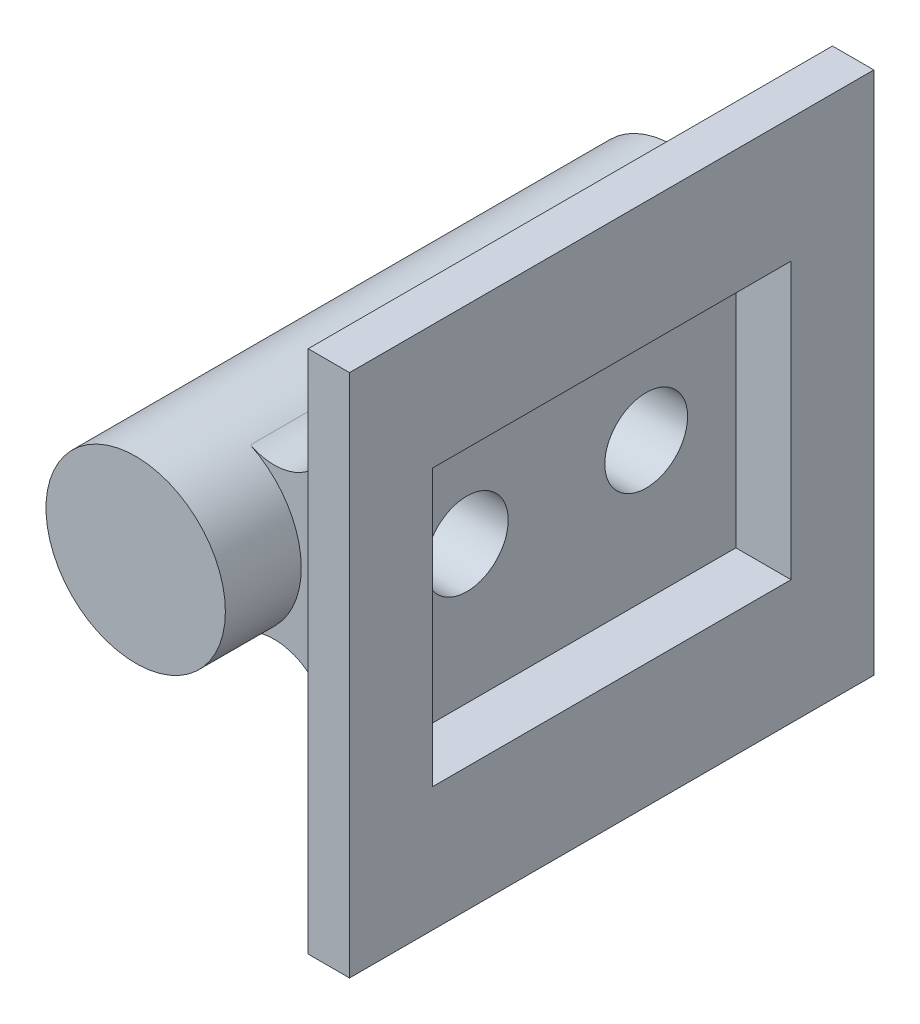
ISO-10303-21;
HEADER;
FILE_DESCRIPTION(('STEP AP214'),'2;1');
FILE_NAME('part.step','',(''),(''),'','','');
FILE_SCHEMA(('AUTOMOTIVE_DESIGN { 1 0 10303 214 1 1 1 1 }'));
ENDSEC;
DATA;
#1=APPLICATION_CONTEXT('core data for automotive mechanical design processes');
#2=APPLICATION_PROTOCOL_DEFINITION('international standard','automotive_design',2000,#1);
#3=PRODUCT_CONTEXT('',#1,'mechanical');
#4=PRODUCT('Part','Part','',(#3));
#5=PRODUCT_RELATED_PRODUCT_CATEGORY('part','',(#4));
#6=PRODUCT_DEFINITION_FORMATION('','',#4);
#7=PRODUCT_DEFINITION_CONTEXT('part definition',#1,'design');
#8=PRODUCT_DEFINITION('design','',#6,#7);
#9=PRODUCT_DEFINITION_SHAPE('','',#8);
#10=(LENGTH_UNIT() NAMED_UNIT(*) SI_UNIT(.MILLI.,.METRE.));
#11=(NAMED_UNIT(*) PLANE_ANGLE_UNIT() SI_UNIT($,.RADIAN.));
#12=(NAMED_UNIT(*) SI_UNIT($,.STERADIAN.) SOLID_ANGLE_UNIT());
#13=UNCERTAINTY_MEASURE_WITH_UNIT(LENGTH_MEASURE(1.E-05),#10,'distance_accuracy_value','');
#14=(GEOMETRIC_REPRESENTATION_CONTEXT(3) GLOBAL_UNCERTAINTY_ASSIGNED_CONTEXT((#13)) GLOBAL_UNIT_ASSIGNED_CONTEXT((#10,
#11,#12)) REPRESENTATION_CONTEXT('',''));
#15=CARTESIAN_POINT('',(0.,0.,0.));
#16=DIRECTION('',(0.,0.,1.));
#17=DIRECTION('',(1.,0.,0.));
#18=AXIS2_PLACEMENT_3D('',#15,#16,#17);
#19=CARTESIAN_POINT('',(-3.25,0.,6.50000000000001));
#20=DIRECTION('',(1.,0.,0.));
#21=DIRECTION('',(0.,0.,-1.));
#22=AXIS2_PLACEMENT_3D('',#19,#20,#21);
#23=CYLINDRICAL_SURFACE('',#22,1.5);
#24=CARTESIAN_POINT('',(-3.25,0.,5.00000000000001));
#25=CARTESIAN_POINT('',(-3.24999648247277,0.0795665336020403,5.00000421247905));
#26=CARTESIAN_POINT('',(-3.24704578523041,0.159248802751997,5.00636813471365));
#27=CARTESIAN_POINT('',(-3.2355347898597,0.316302676462146,5.03156318118426));
#28=CARTESIAN_POINT('',(-3.22696181322454,0.393668644355888,5.05042248408738));
#29=CARTESIAN_POINT('',(-3.2051126172015,0.543571236651894,5.09973866091747));
#30=CARTESIAN_POINT('',(-3.19185368124057,0.616124459577146,5.13015294660304));
#31=CARTESIAN_POINT('',(-3.16188428643622,0.755011505863267,5.2015168335497));
#32=CARTESIAN_POINT('',(-3.14517445431165,0.821346455351668,5.2424645221658));
#33=CARTESIAN_POINT('',(-3.10883035500972,0.949934488652827,5.33625870420049));
#34=CARTESIAN_POINT('',(-3.08908710707928,1.01177584846844,5.38962691087942));
#35=CARTESIAN_POINT('',(-3.04931006025544,1.12599874800721,5.50563562764809));
#36=CARTESIAN_POINT('',(-3.02927608328388,1.17837420047775,5.56828205752165));
#37=CARTESIAN_POINT('',(-2.98974101022941,1.27548887178323,5.70586094331575));
#38=CARTESIAN_POINT('',(-2.97035435123641,1.31953284801044,5.78132069821355));
#39=CARTESIAN_POINT('',(-2.93608939546151,1.39412192936299,5.93958674698915));
#40=CARTESIAN_POINT('',(-2.92120827864052,1.42467548371612,6.0223884033991));
#41=CARTESIAN_POINT('',(-2.89884571395906,1.46962454078475,6.18827547315313));
#42=CARTESIAN_POINT('',(-2.8910015734653,1.4848179245708,6.27109361958574));
#43=CARTESIAN_POINT('',(-2.88259066686592,1.50108773838038,6.43844572930717));
#44=CARTESIAN_POINT('',(-2.88201842715938,1.50217478633585,6.52297835408688));
#45=CARTESIAN_POINT('',(-2.88791642352155,1.49079280088205,6.68247431559392));
#46=CARTESIAN_POINT('',(-2.89370119933259,1.47964335102251,6.75756278880917));
#47=CARTESIAN_POINT('',(-2.91048067828192,1.44635609280636,6.90465111612117));
#48=CARTESIAN_POINT('',(-2.92147667875396,1.42421554815286,6.97665019624376));
#49=CARTESIAN_POINT('',(-2.94769456359194,1.36913890476633,7.11750428412667));
#50=CARTESIAN_POINT('',(-2.96300763226557,1.33596673085205,7.18624922737944));
#51=CARTESIAN_POINT('',(-2.99612519429948,1.2599408085694,7.31750076894383));
#52=CARTESIAN_POINT('',(-3.01393076717331,1.21708286028503,7.38000464401993));
#53=CARTESIAN_POINT('',(-3.05231404472979,1.11759089744586,7.50397040691343));
#54=CARTESIAN_POINT('',(-3.07298560052006,1.05997849303938,7.56462052865888));
#55=CARTESIAN_POINT('',(-3.11321361515149,0.935250632841352,7.67570550486449));
#56=CARTESIAN_POINT('',(-3.13276968136724,0.868131859637576,7.72613677828395));
#57=CARTESIAN_POINT('',(-3.16938837780687,0.723348423753624,7.81693190630663));
#58=CARTESIAN_POINT('',(-3.18634309674009,0.645401966429365,7.85689330775828));
#59=CARTESIAN_POINT('',(-3.21497815103089,0.482909298354604,7.92283936054928));
#60=CARTESIAN_POINT('',(-3.22666207188811,0.398367620109635,7.94883351551928));
#61=CARTESIAN_POINT('',(-3.2427218040747,0.231801419726402,7.98424157682711));
#62=CARTESIAN_POINT('',(-3.24757449131577,0.150053680320637,7.99474020756894));
#63=CARTESIAN_POINT('',(-3.25100513162603,-0.0141754579229654,8.00218106493396));
#64=CARTESIAN_POINT('',(-3.2495854463303,-0.0966565689646155,7.9991283938078));
#65=CARTESIAN_POINT('',(-3.24092695083229,-0.254447728851398,7.98025949138189));
#66=CARTESIAN_POINT('',(-3.23406471548409,-0.32987981592277,7.96526898368199));
#67=CARTESIAN_POINT('',(-3.21565473000495,-0.477039681748182,7.92417402923192));
#68=CARTESIAN_POINT('',(-3.20410642645936,-0.548767021851264,7.89806826977628));
#69=CARTESIAN_POINT('',(-3.17695345815228,-0.689005049925915,7.83468234372052));
#70=CARTESIAN_POINT('',(-3.1612347190555,-0.757348407882686,7.79708250267826));
#71=CARTESIAN_POINT('',(-3.12733589867659,-0.88699936318638,7.71212462567629));
#72=CARTESIAN_POINT('',(-3.10915473706587,-0.948303850462287,7.66476230187561));
#73=CARTESIAN_POINT('',(-3.07030240901949,-1.0677160558966,7.55688298141909));
#74=CARTESIAN_POINT('',(-3.04955167366765,-1.12509321772053,7.4955841650681));
#75=CARTESIAN_POINT('',(-3.00917431114152,-1.22901796417977,7.36402884468214));
#76=CARTESIAN_POINT('',(-2.9895481899615,-1.27556070251232,7.293768353704));
#77=CARTESIAN_POINT('',(-2.95315331683976,-1.35774539209928,7.1434877774402));
#78=CARTESIAN_POINT('',(-2.93648892202037,-1.39301513194685,7.06323680814686));
#79=CARTESIAN_POINT('',(-2.90918351058036,-1.44918714325353,6.89691227690631));
#80=CARTESIAN_POINT('',(-2.89853600922792,-1.47010488786372,6.81084509588307));
#81=CARTESIAN_POINT('',(-2.88561745322169,-1.49529060984287,6.64356783076452));
#82=CARTESIAN_POINT('',(-2.8826853235251,-1.50087454782971,6.56260705814636));
#83=CARTESIAN_POINT('',(-2.88371144444688,-1.49890349615771,6.40090062167266));
#84=CARTESIAN_POINT('',(-2.88766788080262,-1.49135196602765,6.32015490678602));
#85=CARTESIAN_POINT('',(-2.90136714358001,-1.4645026372222,6.16705490877214));
#86=CARTESIAN_POINT('',(-2.91068674382725,-1.44606164108053,6.09450832744066));
#87=CARTESIAN_POINT('',(-2.93364049026732,-1.39890570133608,5.95356687370679));
#88=CARTESIAN_POINT('',(-2.94727591136076,-1.37018772156748,5.88517323521492));
#89=CARTESIAN_POINT('',(-2.97843128061352,-1.30114142777073,5.74953399950376));
#90=CARTESIAN_POINT('',(-2.99614786625048,-1.26017322224185,5.68266041329159));
#91=CARTESIAN_POINT('',(-3.0330436879651,-1.16858143831046,5.55633112462378));
#92=CARTESIAN_POINT('',(-3.05222358907507,-1.11795345395621,5.49687882766469));
#93=CARTESIAN_POINT('',(-3.09212207628571,-1.00267081983323,5.38109157335565));
#94=CARTESIAN_POINT('',(-3.1128088140642,-0.937130722089634,5.32562265597413));
#95=CARTESIAN_POINT('',(-3.15160236946607,-0.796983612052283,5.22634804014506));
#96=CARTESIAN_POINT('',(-3.16970797320059,-0.722372364022922,5.18254782104581));
#97=CARTESIAN_POINT('',(-3.2012362062055,-0.566452903867861,5.10840626489357));
#98=CARTESIAN_POINT('',(-3.21469015731665,-0.485194228853799,5.07797451998735));
#99=CARTESIAN_POINT('',(-3.23548841356123,-0.318047129151275,5.03155777804299));
#100=CARTESIAN_POINT('',(-3.24285100595264,-0.232173392454847,5.01552952677662));
#101=CARTESIAN_POINT('',(-3.24782399252521,-0.121381352624892,5.00472033900516));
#102=CARTESIAN_POINT('',(-3.24863841958619,-0.0971493876498603,5.00295206813927));
#103=CARTESIAN_POINT('',(-3.24972696562435,-0.0486152181100393,5.00059124442133));
#104=CARTESIAN_POINT('',(-3.2500010748449,-0.0243130122848309,4.99999871279985));
#105=CARTESIAN_POINT('',(-3.25,0.,5.00000000000001));
#106=B_SPLINE_CURVE_WITH_KNOTS('',3,(#24,#25,#26,#27,#28,#29,#30,#31,#32,#33,#34,#35,#36,#37,
#38,#39,#40,#41,#42,#43,#44,#45,#46,#47,#48,#49,#50,#51,#52,#53,#54,#55,#56,#57,#58,#59,#60,#61,
#62,#63,#64,#65,#66,#67,#68,#69,#70,#71,#72,#73,#74,#75,#76,#77,#78,#79,#80,#81,#82,#83,#84,#85,
#86,#87,#88,#89,#90,#91,#92,#93,#94,#95,#96,#97,#98,#99,#100,#101,#102,#103,#104,#105),
.UNSPECIFIED.,.T.,.F.,(4,2,2,2,2,2,2,2,2,2,2,2,2,2,2,2,2,2,2,2,2,2,2,2,2,2,2,2,2,2,2,2,2,2,2,2,
2,2,2,2,4),(0.,0.238600102483912,0.477740118245303,0.716007153654804,0.954230955270993,
1.20527368348811,1.45647728005178,1.72361737244145,1.99058991333629,2.24284530975915,
2.49491082085964,2.72224505371487,2.94963591115234,3.1822448933896,3.41495493301191,
3.67231630672516,3.92976771345169,4.19600797435801,4.46206684922304,4.70843465098172,
4.95470969975967,5.18529144757862,5.41590043453885,5.65361863134684,5.8914414611822,
6.14975555625562,6.4081849756982,6.67442949381559,6.94038651584684,7.18267705005868,
7.42490378112663,7.65022078469501,7.87560440949579,8.11582604918683,8.3561575201829,
8.61987112719259,8.88370835055027,9.14573275427444,9.40696763362011,9.47987495044763,
9.5527835837666),.UNSPECIFIED.);
#107=CARTESIAN_POINT('',(-3.25,0.,5.00000000000001));
#108=VERTEX_POINT('',#107);
#109=EDGE_CURVE('E236',#108,#108,#106,.T.);
#110=ORIENTED_EDGE('',*,*,#109,.F.);
#111=EDGE_LOOP('',(#110));
#112=FACE_BOUND('',#111,.T.);
#113=CARTESIAN_POINT('',(5.5,0.,6.50000000000001));
#114=DIRECTION('',(1.,0.,0.));
#115=DIRECTION('',(0.,0.,-1.));
#116=AXIS2_PLACEMENT_3D('',#113,#114,#115);
#117=CIRCLE('',#116,1.5);
#118=CARTESIAN_POINT('',(5.5,0.,5.00000000000001));
#119=VERTEX_POINT('',#118);
#120=EDGE_CURVE('E232',#119,#119,#117,.F.);
#121=ORIENTED_EDGE('',*,*,#120,.F.);
#122=EDGE_LOOP('',(#121));
#123=FACE_BOUND('',#122,.T.);
#124=ADVANCED_FACE('F44',(#112,#123),#23,.F.);
#125=CARTESIAN_POINT('',(-3.25,0.,13.));
#126=DIRECTION('',(1.,0.,0.));
#127=DIRECTION('',(0.,0.,-1.));
#128=AXIS2_PLACEMENT_3D('',#125,#126,#127);
#129=CYLINDRICAL_SURFACE('',#128,1.5);
#130=CARTESIAN_POINT('',(-3.25,0.,11.5));
#131=CARTESIAN_POINT('',(-3.24999648247277,0.0795665336020403,11.500004212479));
#132=CARTESIAN_POINT('',(-3.24704578523041,0.159248802751997,11.5063681347136));
#133=CARTESIAN_POINT('',(-3.2355347898597,0.316302676462146,11.5315631811843));
#134=CARTESIAN_POINT('',(-3.22696181322454,0.393668644355888,11.5504224840874));
#135=CARTESIAN_POINT('',(-3.2051126172015,0.543571236651894,11.5997386609175));
#136=CARTESIAN_POINT('',(-3.19185368124057,0.616124459577146,11.630152946603));
#137=CARTESIAN_POINT('',(-3.16188428643622,0.755011505863267,11.7015168335497));
#138=CARTESIAN_POINT('',(-3.14517445431165,0.821346455351668,11.7424645221658));
#139=CARTESIAN_POINT('',(-3.10883035500972,0.949934488652827,11.8362587042005));
#140=CARTESIAN_POINT('',(-3.08908710707928,1.01177584846844,11.8896269108794));
#141=CARTESIAN_POINT('',(-3.04931006025544,1.12599874800721,12.0056356276481));
#142=CARTESIAN_POINT('',(-3.02927608328388,1.17837420047775,12.0682820575216));
#143=CARTESIAN_POINT('',(-2.9897410102294,1.27548887178323,12.2058609433157));
#144=CARTESIAN_POINT('',(-2.97035435123641,1.31953284801044,12.2813206982136));
#145=CARTESIAN_POINT('',(-2.93608939546151,1.39412192936299,12.4395867469891));
#146=CARTESIAN_POINT('',(-2.92120827864052,1.42467548371612,12.5223884033991));
#147=CARTESIAN_POINT('',(-2.89884571395906,1.46962454078475,12.6882754731531));
#148=CARTESIAN_POINT('',(-2.8910015734653,1.4848179245708,12.7710936195857));
#149=CARTESIAN_POINT('',(-2.88259066686592,1.50108773838038,12.9384457293072));
#150=CARTESIAN_POINT('',(-2.88201842715938,1.50217478633585,13.0229783540869));
#151=CARTESIAN_POINT('',(-2.88791642352155,1.49079280088205,13.1824743155939));
#152=CARTESIAN_POINT('',(-2.89370119933259,1.47964335102251,13.2575627888092));
#153=CARTESIAN_POINT('',(-2.91048067828192,1.44635609280636,13.4046511161212));
#154=CARTESIAN_POINT('',(-2.92147667875396,1.42421554815286,13.4766501962438));
#155=CARTESIAN_POINT('',(-2.94769456359194,1.36913890476633,13.6175042841267));
#156=CARTESIAN_POINT('',(-2.96300763226557,1.33596673085205,13.6862492273794));
#157=CARTESIAN_POINT('',(-2.99612519429948,1.2599408085694,13.8175007689438));
#158=CARTESIAN_POINT('',(-3.01393076717331,1.21708286028503,13.8800046440199));
#159=CARTESIAN_POINT('',(-3.05231404472979,1.11759089744586,14.0039704069134));
#160=CARTESIAN_POINT('',(-3.07298560052006,1.05997849303938,14.0646205286589));
#161=CARTESIAN_POINT('',(-3.11321361515149,0.935250632841354,14.1757055048645));
#162=CARTESIAN_POINT('',(-3.13276968136724,0.868131859637578,14.2261367782839));
#163=CARTESIAN_POINT('',(-3.16938837780687,0.723348423753626,14.3169319063066));
#164=CARTESIAN_POINT('',(-3.18634309674009,0.645401966429367,14.3568933077583));
#165=CARTESIAN_POINT('',(-3.21497815103089,0.482909298354605,14.4228393605493));
#166=CARTESIAN_POINT('',(-3.22666207188811,0.398367620109636,14.4488335155193));
#167=CARTESIAN_POINT('',(-3.2427218040747,0.231801419726403,14.4842415768271));
#168=CARTESIAN_POINT('',(-3.24757449131577,0.150053680320638,14.4947402075689));
#169=CARTESIAN_POINT('',(-3.25100513162603,-0.0141754579229652,14.502181064934));
#170=CARTESIAN_POINT('',(-3.2495854463303,-0.0966565689646154,14.4991283938078));
#171=CARTESIAN_POINT('',(-3.24092695083229,-0.254447728851398,14.4802594913819));
#172=CARTESIAN_POINT('',(-3.23406471548409,-0.32987981592277,14.465268983682));
#173=CARTESIAN_POINT('',(-3.21565473000495,-0.477039681748182,14.4241740292319));
#174=CARTESIAN_POINT('',(-3.20410642645936,-0.548767021851264,14.3980682697763));
#175=CARTESIAN_POINT('',(-3.17695345815228,-0.689005049925915,14.3346823437205));
#176=CARTESIAN_POINT('',(-3.1612347190555,-0.757348407882686,14.2970825026783));
#177=CARTESIAN_POINT('',(-3.12733589867659,-0.88699936318638,14.2121246256763));
#178=CARTESIAN_POINT('',(-3.10915473706587,-0.948303850462288,14.1647623018756));
#179=CARTESIAN_POINT('',(-3.07030240901949,-1.0677160558966,14.0568829814191));
#180=CARTESIAN_POINT('',(-3.04955167366765,-1.12509321772053,13.9955841650681));
#181=CARTESIAN_POINT('',(-3.00917431114152,-1.22901796417977,13.8640288446821));
#182=CARTESIAN_POINT('',(-2.9895481899615,-1.27556070251232,13.793768353704));
#183=CARTESIAN_POINT('',(-2.95315331683976,-1.35774539209928,13.6434877774402));
#184=CARTESIAN_POINT('',(-2.93648892202037,-1.39301513194685,13.5632368081469));
#185=CARTESIAN_POINT('',(-2.90918351058036,-1.44918714325353,13.3969122769063));
#186=CARTESIAN_POINT('',(-2.89853600922792,-1.47010488786372,13.3108450958831));
#187=CARTESIAN_POINT('',(-2.88561745322169,-1.49529060984287,13.1435678307645));
#188=CARTESIAN_POINT('',(-2.8826853235251,-1.50087454782971,13.0626070581464));
#189=CARTESIAN_POINT('',(-2.88371144444688,-1.49890349615772,12.9009006216727));
#190=CARTESIAN_POINT('',(-2.88766788080262,-1.49135196602765,12.820154906786));
#191=CARTESIAN_POINT('',(-2.90136714358001,-1.4645026372222,12.6670549087721));
#192=CARTESIAN_POINT('',(-2.91068674382725,-1.44606164108053,12.5945083274407));
#193=CARTESIAN_POINT('',(-2.93364049026732,-1.39890570133608,12.4535668737068));
#194=CARTESIAN_POINT('',(-2.94727591136076,-1.37018772156748,12.3851732352149));
#195=CARTESIAN_POINT('',(-2.97843128061352,-1.30114142777074,12.2495339995038));
#196=CARTESIAN_POINT('',(-2.99614786625048,-1.26017322224185,12.1826604132916));
#197=CARTESIAN_POINT('',(-3.0330436879651,-1.16858143831046,12.0563311246238));
#198=CARTESIAN_POINT('',(-3.05222358907507,-1.11795345395621,11.9968788276647));
#199=CARTESIAN_POINT('',(-3.09212207628571,-1.00267081983323,11.8810915733557));
#200=CARTESIAN_POINT('',(-3.1128088140642,-0.937130722089635,11.8256226559741));
#201=CARTESIAN_POINT('',(-3.15160236946607,-0.796983612052284,11.7263480401451));
#202=CARTESIAN_POINT('',(-3.16970797320059,-0.722372364022923,11.6825478210458));
#203=CARTESIAN_POINT('',(-3.2012362062055,-0.566452903867862,11.6084062648936));
#204=CARTESIAN_POINT('',(-3.21469015731665,-0.4851942288538,11.5779745199874));
#205=CARTESIAN_POINT('',(-3.23548841356123,-0.318047129151276,11.531557778043));
#206=CARTESIAN_POINT('',(-3.24285100595264,-0.232173392454848,11.5155295267766));
#207=CARTESIAN_POINT('',(-3.24782399252521,-0.121381352624893,11.5047203390052));
#208=CARTESIAN_POINT('',(-3.24863841958619,-0.0971493876498614,11.5029520681393));
#209=CARTESIAN_POINT('',(-3.24972696562435,-0.0486152181100401,11.5005912444213));
#210=CARTESIAN_POINT('',(-3.2500010748449,-0.0243130122848313,11.4999987127998));
#211=CARTESIAN_POINT('',(-3.25,0.,11.5));
#212=B_SPLINE_CURVE_WITH_KNOTS('',3,(#130,#131,#132,#133,#134,#135,#136,#137,#138,#139,#140,
#141,#142,#143,#144,#145,#146,#147,#148,#149,#150,#151,#152,#153,#154,#155,#156,#157,#158,#159,
#160,#161,#162,#163,#164,#165,#166,#167,#168,#169,#170,#171,#172,#173,#174,#175,#176,#177,#178,
#179,#180,#181,#182,#183,#184,#185,#186,#187,#188,#189,#190,#191,#192,#193,#194,#195,#196,#197,
#198,#199,#200,#201,#202,#203,#204,#205,#206,#207,#208,#209,#210,#211),.UNSPECIFIED.,.T.,.F.,(4,
2,2,2,2,2,2,2,2,2,2,2,2,2,2,2,2,2,2,2,2,2,2,2,2,2,2,2,2,2,2,2,2,2,2,2,2,2,2,2,4),(0.,
0.238600102483912,0.477740118245303,0.716007153654804,0.954230955270993,1.20527368348812,
1.45647728005178,1.72361737244145,1.99058991333629,2.24284530975915,2.49491082085964,
2.72224505371487,2.94963591115234,3.1822448933896,3.41495493301191,3.67231630672517,
3.92976771345169,4.19600797435802,4.46206684922304,4.70843465098173,4.95470969975968,
5.18529144757863,5.41590043453886,5.65361863134685,5.89144146118221,6.14975555625563,
6.40818497569821,6.6744294938156,6.94038651584684,7.18267705005868,7.42490378112664,
7.65022078469502,7.8756044094958,8.11582604918684,8.35615752018291,8.6198711271926,
8.88370835055028,9.14573275427445,9.40696763362012,9.47987495044763,9.55278358376661),.UNSPECIFIED.);
#213=CARTESIAN_POINT('',(-3.25,0.,11.5));
#214=VERTEX_POINT('',#213);
#215=EDGE_CURVE('E245',#214,#214,#212,.T.);
#216=ORIENTED_EDGE('',*,*,#215,.F.);
#217=EDGE_LOOP('',(#216));
#218=FACE_BOUND('',#217,.T.);
#219=CARTESIAN_POINT('',(5.5,0.,13.));
#220=DIRECTION('',(1.,0.,0.));
#221=DIRECTION('',(0.,0.,-1.));
#222=AXIS2_PLACEMENT_3D('',#219,#220,#221);
#223=CIRCLE('',#222,1.5);
#224=CARTESIAN_POINT('',(5.5,0.,11.5));
#225=VERTEX_POINT('',#224);
#226=EDGE_CURVE('E48',#225,#225,#223,.F.);
#227=ORIENTED_EDGE('',*,*,#226,.F.);
#228=EDGE_LOOP('',(#227));
#229=FACE_BOUND('',#228,.T.);
#230=ADVANCED_FACE('F258',(#218,#229),#129,.F.);
#231=CARTESIAN_POINT('',(0.,0.,19.5));
#232=DIRECTION('',(0.,0.,-1.));
#233=DIRECTION('',(-1.,0.,0.));
#234=AXIS2_PLACEMENT_3D('',#231,#232,#233);
#235=CYLINDRICAL_SURFACE('',#234,3.25);
#236=ORIENTED_EDGE('',*,*,#215,.T.);
#237=EDGE_LOOP('',(#236));
#238=FACE_BOUND('',#237,.T.);
#239=ORIENTED_EDGE('',*,*,#109,.T.);
#240=EDGE_LOOP('',(#239));
#241=FACE_BOUND('',#240,.T.);
#242=DIRECTION('',(0.,0.,-1.));
#243=VECTOR('',#242,1.);
#244=CARTESIAN_POINT('',(1.40530679379837,-2.93046290119909,19.5));
#245=LINE('',#244,#243);
#246=CARTESIAN_POINT('',(1.40530679379837,-2.93046290119908,2.75));
#247=VERTEX_POINT('',#246);
#248=CARTESIAN_POINT('',(1.40530679379837,-2.93046290119908,16.75));
#249=VERTEX_POINT('',#248);
#250=EDGE_CURVE('E359',#247,#249,#245,.F.);
#251=ORIENTED_EDGE('',*,*,#250,.T.);
#252=CARTESIAN_POINT('',(0.,0.,16.75));
#253=DIRECTION('',(0.,0.,-1.));
#254=DIRECTION('',(-1.,0.,0.));
#255=AXIS2_PLACEMENT_3D('',#252,#253,#254);
#256=CIRCLE('',#255,3.25);
#257=CARTESIAN_POINT('',(1.40530679379837,2.93046290119908,16.75));
#258=VERTEX_POINT('',#257);
#259=EDGE_CURVE('E334',#258,#249,#256,.T.);
#260=ORIENTED_EDGE('',*,*,#259,.F.);
#261=DIRECTION('',(0.,0.,-1.));
#262=VECTOR('',#261,1.);
#263=CARTESIAN_POINT('',(1.40530679379837,2.93046290119908,19.5));
#264=LINE('',#263,#262);
#265=CARTESIAN_POINT('',(1.40530679379837,2.93046290119908,2.75));
#266=VERTEX_POINT('',#265);
#267=EDGE_CURVE('E355',#258,#266,#264,.T.);
#268=ORIENTED_EDGE('',*,*,#267,.T.);
#269=CARTESIAN_POINT('',(0.,0.,2.75));
#270=DIRECTION('',(0.,0.,-1.));
#271=DIRECTION('',(-1.,0.,0.));
#272=AXIS2_PLACEMENT_3D('',#269,#270,#271);
#273=CIRCLE('',#272,3.25);
#274=EDGE_CURVE('E342',#266,#247,#273,.T.);
#275=ORIENTED_EDGE('',*,*,#274,.T.);
#276=EDGE_LOOP('',(#251,#260,#268,#275));
#277=FACE_BOUND('',#276,.T.);
#278=CARTESIAN_POINT('',(0.,0.,19.5));
#279=DIRECTION('',(0.,0.,1.));
#280=DIRECTION('',(1.,0.,0.));
#281=AXIS2_PLACEMENT_3D('',#278,#279,#280);
#282=CIRCLE('',#281,3.25);
#283=CARTESIAN_POINT('',(3.25,0.,19.5));
#284=VERTEX_POINT('',#283);
#285=EDGE_CURVE('E328',#284,#284,#282,.T.);
#286=ORIENTED_EDGE('',*,*,#285,.F.);
#287=EDGE_LOOP('',(#286));
#288=FACE_BOUND('',#287,.T.);
#289=CARTESIAN_POINT('',(0.,0.,0.));
#290=DIRECTION('',(0.,0.,1.));
#291=DIRECTION('',(1.,0.,0.));
#292=AXIS2_PLACEMENT_3D('',#289,#290,#291);
#293=CIRCLE('',#292,3.25);
#294=CARTESIAN_POINT('',(3.25,0.,0.));
#295=VERTEX_POINT('',#294);
#296=EDGE_CURVE('E325',#295,#295,#293,.T.);
#297=ORIENTED_EDGE('',*,*,#296,.T.);
#298=EDGE_LOOP('',(#297));
#299=FACE_BOUND('',#298,.T.);
#300=ADVANCED_FACE('F251',(#238,#241,#277,#288,#299),#235,.T.);
#301=CARTESIAN_POINT('',(0.,0.,19.5));
#302=DIRECTION('',(0.,0.,1.));
#303=DIRECTION('',(1.,0.,0.));
#304=AXIS2_PLACEMENT_3D('',#301,#302,#303);
#305=PLANE('',#304);
#306=ORIENTED_EDGE('',*,*,#285,.T.);
#307=EDGE_LOOP('',(#306));
#308=FACE_BOUND('',#307,.T.);
#309=ADVANCED_FACE('F316',(#308),#305,.T.);
#310=CARTESIAN_POINT('',(0.,0.,0.));
#311=DIRECTION('',(0.,0.,1.));
#312=DIRECTION('',(1.,0.,0.));
#313=AXIS2_PLACEMENT_3D('',#310,#311,#312);
#314=PLANE('',#313);
#315=ORIENTED_EDGE('',*,*,#296,.F.);
#316=EDGE_LOOP('',(#315));
#317=FACE_BOUND('',#316,.T.);
#318=ADVANCED_FACE('F314',(#317),#314,.F.);
#319=CARTESIAN_POINT('',(5.,-4.5,27.045630140987));
#320=DIRECTION('',(-0.66896473162245,-0.743294146247166,0.));
#321=DIRECTION('',(0.743294146247166,-0.66896473162245,0.));
#322=AXIS2_PLACEMENT_3D('',#319,#320,#321);
#323=PLANE('',#322);
#324=DIRECTION('',(-0.743294146247166,0.66896473162245,0.));
#325=VECTOR('',#324,1.);
#326=CARTESIAN_POINT('',(5.,-4.5,2.75));
#327=LINE('',#326,#325);
#328=CARTESIAN_POINT('',(4.3379294632449,-3.90413651692041,2.75));
#329=VERTEX_POINT('',#328);
#330=CARTESIAN_POINT('',(3.60804043784226,-3.24723639405803,2.75));
#331=VERTEX_POINT('',#330);
#332=EDGE_CURVE('E420',#329,#331,#327,.T.);
#333=ORIENTED_EDGE('',*,*,#332,.F.);
#334=DIRECTION('',(0.,0.,-1.));
#335=VECTOR('',#334,1.);
#336=CARTESIAN_POINT('',(4.3379294632449,-3.90413651692041,27.045630140987));
#337=LINE('',#336,#335);
#338=CARTESIAN_POINT('',(4.3379294632449,-3.90413651692041,16.75));
#339=VERTEX_POINT('',#338);
#340=EDGE_CURVE('E352',#329,#339,#337,.F.);
#341=ORIENTED_EDGE('',*,*,#340,.T.);
#342=DIRECTION('',(0.743294146247166,-0.66896473162245,0.));
#343=VECTOR('',#342,1.);
#344=CARTESIAN_POINT('',(5.,-4.5,16.75));
#345=LINE('',#344,#343);
#346=CARTESIAN_POINT('',(3.60804043784226,-3.24723639405803,16.75));
#347=VERTEX_POINT('',#346);
#348=EDGE_CURVE('E337',#347,#339,#345,.T.);
#349=ORIENTED_EDGE('',*,*,#348,.F.);
#350=DIRECTION('',(0.,0.,-1.));
#351=VECTOR('',#350,1.);
#352=CARTESIAN_POINT('',(3.60804043784226,-3.24723639405803,27.045630140987));
#353=LINE('',#352,#351);
#354=EDGE_CURVE('E349',#347,#331,#353,.T.);
#355=ORIENTED_EDGE('',*,*,#354,.T.);
#356=EDGE_LOOP('',(#333,#341,#349,#355));
#357=FACE_BOUND('',#356,.T.);
#358=ADVANCED_FACE('F310',(#357),#323,.T.);
#359=CARTESIAN_POINT('',(0.,0.,27.045630140987));
#360=DIRECTION('',(-0.66896473162245,0.743294146247166,0.));
#361=DIRECTION('',(-0.743294146247166,-0.66896473162245,0.));
#362=AXIS2_PLACEMENT_3D('',#359,#360,#361);
#363=PLANE('',#362);
#364=DIRECTION('',(0.743294146247166,0.66896473162245,0.));
#365=VECTOR('',#364,1.);
#366=CARTESIAN_POINT('',(0.,0.,2.75));
#367=LINE('',#366,#365);
#368=CARTESIAN_POINT('',(3.60804043784226,3.24723639405803,2.75));
#369=VERTEX_POINT('',#368);
#370=CARTESIAN_POINT('',(4.3379294632449,3.90413651692041,2.75));
#371=VERTEX_POINT('',#370);
#372=EDGE_CURVE('E417',#369,#371,#367,.T.);
#373=ORIENTED_EDGE('',*,*,#372,.F.);
#374=DIRECTION('',(0.,0.,-1.));
#375=VECTOR('',#374,1.);
#376=CARTESIAN_POINT('',(3.60804043784226,3.24723639405803,27.045630140987));
#377=LINE('',#376,#375);
#378=CARTESIAN_POINT('',(3.60804043784226,3.24723639405803,16.75));
#379=VERTEX_POINT('',#378);
#380=EDGE_CURVE('E367',#369,#379,#377,.F.);
#381=ORIENTED_EDGE('',*,*,#380,.T.);
#382=DIRECTION('',(-0.743294146247166,-0.66896473162245,0.));
#383=VECTOR('',#382,1.);
#384=CARTESIAN_POINT('',(0.,0.,16.75));
#385=LINE('',#384,#383);
#386=CARTESIAN_POINT('',(4.3379294632449,3.90413651692041,16.75));
#387=VERTEX_POINT('',#386);
#388=EDGE_CURVE('E329',#387,#379,#385,.T.);
#389=ORIENTED_EDGE('',*,*,#388,.F.);
#390=DIRECTION('',(0.,0.,-1.));
#391=VECTOR('',#390,1.);
#392=CARTESIAN_POINT('',(4.3379294632449,3.90413651692041,27.045630140987));
#393=LINE('',#392,#391);
#394=EDGE_CURVE('E363',#387,#371,#393,.T.);
#395=ORIENTED_EDGE('',*,*,#394,.T.);
#396=EDGE_LOOP('',(#373,#381,#389,#395));
#397=FACE_BOUND('',#396,.T.);
#398=ADVANCED_FACE('F307',(#397),#363,.T.);
#399=CARTESIAN_POINT('',(0.,0.,2.75));
#400=DIRECTION('',(0.,0.,-1.));
#401=DIRECTION('',(-1.,0.,0.));
#402=AXIS2_PLACEMENT_3D('',#399,#400,#401);
#403=PLANE('',#402);
#404=ORIENTED_EDGE('',*,*,#274,.F.);
#405=CARTESIAN_POINT('',(2.27011097459736,4.73382468655237,2.75));
#406=DIRECTION('',(0.,0.,-1.));
#407=DIRECTION('',(-1.,0.,0.));
#408=AXIS2_PLACEMENT_3D('',#405,#406,#407);
#409=CIRCLE('',#408,2.);
#410=EDGE_CURVE('E386',#266,#369,#409,.F.);
#411=ORIENTED_EDGE('',*,*,#410,.T.);
#412=ORIENTED_EDGE('',*,*,#372,.T.);
#413=CARTESIAN_POINT('',(3.,5.39072480941474,2.75));
#414=DIRECTION('',(0.,0.,-1.));
#415=DIRECTION('',(-1.,0.,0.));
#416=AXIS2_PLACEMENT_3D('',#413,#414,#415);
#417=CIRCLE('',#416,2.);
#418=CARTESIAN_POINT('',(5.,5.39072480941474,2.75));
#419=VERTEX_POINT('',#418);
#420=EDGE_CURVE('E54',#371,#419,#417,.F.);
#421=ORIENTED_EDGE('',*,*,#420,.T.);
#422=DIRECTION('',(0.,1.,0.));
#423=VECTOR('',#422,1.);
#424=CARTESIAN_POINT('',(5.,-6.,2.75));
#425=LINE('',#424,#423);
#426=CARTESIAN_POINT('',(5.,6.,2.75));
#427=VERTEX_POINT('',#426);
#428=EDGE_CURVE('E453',#419,#427,#425,.T.);
#429=ORIENTED_EDGE('',*,*,#428,.T.);
#430=DIRECTION('',(-1.,0.,0.));
#431=VECTOR('',#430,1.);
#432=CARTESIAN_POINT('',(6.,6.,2.75));
#433=LINE('',#432,#431);
#434=CARTESIAN_POINT('',(6.,6.,2.75));
#435=VERTEX_POINT('',#434);
#436=EDGE_CURVE('E433',#435,#427,#433,.T.);
#437=ORIENTED_EDGE('',*,*,#436,.F.);
#438=DIRECTION('',(0.,1.,0.));
#439=VECTOR('',#438,1.);
#440=CARTESIAN_POINT('',(6.,-6.,2.75));
#441=LINE('',#440,#439);
#442=CARTESIAN_POINT('',(6.,-6.,2.75));
#443=VERTEX_POINT('',#442);
#444=EDGE_CURVE('E464',#443,#435,#441,.T.);
#445=ORIENTED_EDGE('',*,*,#444,.F.);
#446=DIRECTION('',(-1.,0.,0.));
#447=VECTOR('',#446,1.);
#448=CARTESIAN_POINT('',(6.,-6.,2.75));
#449=LINE('',#448,#447);
#450=CARTESIAN_POINT('',(5.,-6.,2.75));
#451=VERTEX_POINT('',#450);
#452=EDGE_CURVE('E429',#443,#451,#449,.T.);
#453=ORIENTED_EDGE('',*,*,#452,.T.);
#454=CARTESIAN_POINT('',(5.,-5.39072480941474,2.75));
#455=VERTEX_POINT('',#454);
#456=EDGE_CURVE('E450',#451,#455,#425,.T.);
#457=ORIENTED_EDGE('',*,*,#456,.T.);
#458=CARTESIAN_POINT('',(3.,-5.39072480941474,2.75));
#459=DIRECTION('',(0.,0.,-1.));
#460=DIRECTION('',(-1.,0.,0.));
#461=AXIS2_PLACEMENT_3D('',#458,#459,#460);
#462=CIRCLE('',#461,2.);
#463=EDGE_CURVE('E373',#455,#329,#462,.F.);
#464=ORIENTED_EDGE('',*,*,#463,.T.);
#465=ORIENTED_EDGE('',*,*,#332,.T.);
#466=CARTESIAN_POINT('',(2.27011097459736,-4.73382468655237,2.75));
#467=DIRECTION('',(0.,0.,-1.));
#468=DIRECTION('',(-1.,0.,0.));
#469=AXIS2_PLACEMENT_3D('',#466,#467,#468);
#470=CIRCLE('',#469,2.);
#471=EDGE_CURVE('E382',#331,#247,#470,.F.);
#472=ORIENTED_EDGE('',*,*,#471,.T.);
#473=EDGE_LOOP('',(#404,#411,#412,#421,#429,#437,#445,#453,#457,#464,#465,#472));
#474=FACE_BOUND('',#473,.T.);
#475=ADVANCED_FACE('F303',(#474),#403,.T.);
#476=CARTESIAN_POINT('',(6.,-6.,16.75));
#477=DIRECTION('',(0.,0.,-1.));
#478=DIRECTION('',(-1.,0.,0.));
#479=AXIS2_PLACEMENT_3D('',#476,#477,#478);
#480=PLANE('',#479);
#481=DIRECTION('',(0.,-1.,0.));
#482=VECTOR('',#481,1.);
#483=CARTESIAN_POINT('',(5.,-6.,16.75));
#484=LINE('',#483,#482);
#485=CARTESIAN_POINT('',(5.,6.,16.75));
#486=VERTEX_POINT('',#485);
#487=CARTESIAN_POINT('',(5.,5.39072480941474,16.75));
#488=VERTEX_POINT('',#487);
#489=EDGE_CURVE('E457',#486,#488,#484,.T.);
#490=ORIENTED_EDGE('',*,*,#489,.T.);
#491=CARTESIAN_POINT('',(3.,5.39072480941474,16.75));
#492=DIRECTION('',(0.,0.,-1.));
#493=DIRECTION('',(-1.,0.,0.));
#494=AXIS2_PLACEMENT_3D('',#491,#492,#493);
#495=CIRCLE('',#494,2.);
#496=EDGE_CURVE('E11',#488,#387,#495,.T.);
#497=ORIENTED_EDGE('',*,*,#496,.T.);
#498=ORIENTED_EDGE('',*,*,#388,.T.);
#499=CARTESIAN_POINT('',(2.27011097459736,4.73382468655237,16.75));
#500=DIRECTION('',(0.,0.,-1.));
#501=DIRECTION('',(-1.,0.,0.));
#502=AXIS2_PLACEMENT_3D('',#499,#500,#501);
#503=CIRCLE('',#502,2.);
#504=EDGE_CURVE('E389',#379,#258,#503,.T.);
#505=ORIENTED_EDGE('',*,*,#504,.T.);
#506=ORIENTED_EDGE('',*,*,#259,.T.);
#507=CARTESIAN_POINT('',(2.27011097459736,-4.73382468655237,16.75));
#508=DIRECTION('',(0.,0.,-1.));
#509=DIRECTION('',(-1.,0.,0.));
#510=AXIS2_PLACEMENT_3D('',#507,#508,#509);
#511=CIRCLE('',#510,2.);
#512=EDGE_CURVE('E379',#249,#347,#511,.T.);
#513=ORIENTED_EDGE('',*,*,#512,.T.);
#514=ORIENTED_EDGE('',*,*,#348,.T.);
#515=CARTESIAN_POINT('',(3.,-5.39072480941474,16.75));
#516=DIRECTION('',(0.,0.,-1.));
#517=DIRECTION('',(-1.,0.,0.));
#518=AXIS2_PLACEMENT_3D('',#515,#516,#517);
#519=CIRCLE('',#518,2.);
#520=CARTESIAN_POINT('',(5.,-5.39072480941474,16.75));
#521=VERTEX_POINT('',#520);
#522=EDGE_CURVE('E376',#339,#521,#519,.T.);
#523=ORIENTED_EDGE('',*,*,#522,.T.);
#524=CARTESIAN_POINT('',(5.,-6.,16.75));
#525=VERTEX_POINT('',#524);
#526=EDGE_CURVE('E460',#521,#525,#484,.T.);
#527=ORIENTED_EDGE('',*,*,#526,.T.);
#528=DIRECTION('',(-1.,0.,0.));
#529=VECTOR('',#528,1.);
#530=CARTESIAN_POINT('',(6.,-6.,16.75));
#531=LINE('',#530,#529);
#532=CARTESIAN_POINT('',(6.,-6.,16.75));
#533=VERTEX_POINT('',#532);
#534=EDGE_CURVE('E424',#533,#525,#531,.T.);
#535=ORIENTED_EDGE('',*,*,#534,.F.);
#536=DIRECTION('',(0.,-1.,0.));
#537=VECTOR('',#536,1.);
#538=CARTESIAN_POINT('',(6.,-6.,16.75));
#539=LINE('',#538,#537);
#540=CARTESIAN_POINT('',(6.,6.,16.75));
#541=VERTEX_POINT('',#540);
#542=EDGE_CURVE('E449',#541,#533,#539,.T.);
#543=ORIENTED_EDGE('',*,*,#542,.F.);
#544=DIRECTION('',(-1.,0.,0.));
#545=VECTOR('',#544,1.);
#546=CARTESIAN_POINT('',(6.,6.,16.75));
#547=LINE('',#546,#545);
#548=EDGE_CURVE('E439',#541,#486,#547,.T.);
#549=ORIENTED_EDGE('',*,*,#548,.T.);
#550=EDGE_LOOP('',(#490,#497,#498,#505,#506,#513,#514,#523,#527,#535,#543,#549));
#551=FACE_BOUND('',#550,.T.);
#552=ADVANCED_FACE('F300',(#551),#480,.F.);
#553=CARTESIAN_POINT('',(5.,0.,0.));
#554=DIRECTION('',(1.,0.,0.));
#555=DIRECTION('',(0.,0.,-1.));
#556=AXIS2_PLACEMENT_3D('',#553,#554,#555);
#557=PLANE('',#556);
#558=ORIENTED_EDGE('',*,*,#526,.F.);
#559=DIRECTION('',(0.,0.,-1.));
#560=VECTOR('',#559,1.);
#561=CARTESIAN_POINT('',(5.,-5.39072480941474,0.));
#562=LINE('',#561,#560);
#563=EDGE_CURVE('E345',#521,#455,#562,.T.);
#564=ORIENTED_EDGE('',*,*,#563,.T.);
#565=ORIENTED_EDGE('',*,*,#456,.F.);
#566=DIRECTION('',(0.,0.,-1.));
#567=VECTOR('',#566,1.);
#568=CARTESIAN_POINT('',(5.,-6.,2.75));
#569=LINE('',#568,#567);
#570=EDGE_CURVE('E454',#525,#451,#569,.T.);
#571=ORIENTED_EDGE('',*,*,#570,.F.);
#572=EDGE_LOOP('',(#558,#564,#565,#571));
#573=FACE_BOUND('',#572,.T.);
#574=ADVANCED_FACE('F292',(#573),#557,.F.);
#575=CARTESIAN_POINT('',(6.,-6.,2.75));
#576=DIRECTION('',(0.,1.,0.));
#577=DIRECTION('',(0.,0.,1.));
#578=AXIS2_PLACEMENT_3D('',#575,#576,#577);
#579=PLANE('',#578);
#580=ORIENTED_EDGE('',*,*,#570,.T.);
#581=ORIENTED_EDGE('',*,*,#452,.F.);
#582=DIRECTION('',(0.,0.,-1.));
#583=VECTOR('',#582,1.);
#584=CARTESIAN_POINT('',(6.,-6.,2.75));
#585=LINE('',#584,#583);
#586=EDGE_CURVE('E468',#533,#443,#585,.T.);
#587=ORIENTED_EDGE('',*,*,#586,.F.);
#588=ORIENTED_EDGE('',*,*,#534,.T.);
#589=EDGE_LOOP('',(#580,#581,#587,#588));
#590=FACE_BOUND('',#589,.T.);
#591=ADVANCED_FACE('F295',(#590),#579,.F.);
#592=CARTESIAN_POINT('',(6.,6.,2.75));
#593=DIRECTION('',(0.,-1.,0.));
#594=DIRECTION('',(0.,0.,-1.));
#595=AXIS2_PLACEMENT_3D('',#592,#593,#594);
#596=PLANE('',#595);
#597=DIRECTION('',(0.,0.,1.));
#598=VECTOR('',#597,1.);
#599=CARTESIAN_POINT('',(5.,6.,2.75));
#600=LINE('',#599,#598);
#601=EDGE_CURVE('E446',#427,#486,#600,.T.);
#602=ORIENTED_EDGE('',*,*,#601,.T.);
#603=ORIENTED_EDGE('',*,*,#548,.F.);
#604=DIRECTION('',(0.,0.,1.));
#605=VECTOR('',#604,1.);
#606=CARTESIAN_POINT('',(6.,6.,2.75));
#607=LINE('',#606,#605);
#608=EDGE_CURVE('E445',#435,#541,#607,.T.);
#609=ORIENTED_EDGE('',*,*,#608,.F.);
#610=ORIENTED_EDGE('',*,*,#436,.T.);
#611=EDGE_LOOP('',(#602,#603,#609,#610));
#612=FACE_BOUND('',#611,.T.);
#613=ADVANCED_FACE('F290',(#612),#596,.F.);
#614=ORIENTED_EDGE('',*,*,#428,.F.);
#615=DIRECTION('',(0.,0.,-1.));
#616=VECTOR('',#615,1.);
#617=CARTESIAN_POINT('',(5.,5.39072480941474,0.));
#618=LINE('',#617,#616);
#619=EDGE_CURVE('E370',#419,#488,#618,.F.);
#620=ORIENTED_EDGE('',*,*,#619,.T.);
#621=ORIENTED_EDGE('',*,*,#489,.F.);
#622=ORIENTED_EDGE('',*,*,#601,.F.);
#623=EDGE_LOOP('',(#614,#620,#621,#622));
#624=FACE_BOUND('',#623,.T.);
#625=ADVANCED_FACE('F286',(#624),#557,.F.);
#626=CARTESIAN_POINT('',(3.,-5.39072480941474,0.));
#627=DIRECTION('',(0.,0.,-1.));
#628=DIRECTION('',(-1.,0.,0.));
#629=AXIS2_PLACEMENT_3D('',#626,#627,#628);
#630=CYLINDRICAL_SURFACE('',#629,2.);
#631=ORIENTED_EDGE('',*,*,#522,.F.);
#632=ORIENTED_EDGE('',*,*,#340,.F.);
#633=ORIENTED_EDGE('',*,*,#463,.F.);
#634=ORIENTED_EDGE('',*,*,#563,.F.);
#635=EDGE_LOOP('',(#631,#632,#633,#634));
#636=FACE_BOUND('',#635,.T.);
#637=ADVANCED_FACE('F289',(#636),#630,.F.);
#638=CARTESIAN_POINT('',(2.27011097459736,-4.73382468655237,19.5));
#639=DIRECTION('',(0.,0.,-1.));
#640=DIRECTION('',(-1.,0.,0.));
#641=AXIS2_PLACEMENT_3D('',#638,#639,#640);
#642=CYLINDRICAL_SURFACE('',#641,2.);
#643=ORIENTED_EDGE('',*,*,#471,.F.);
#644=ORIENTED_EDGE('',*,*,#354,.F.);
#645=ORIENTED_EDGE('',*,*,#512,.F.);
#646=ORIENTED_EDGE('',*,*,#250,.F.);
#647=EDGE_LOOP('',(#643,#644,#645,#646));
#648=FACE_BOUND('',#647,.T.);
#649=ADVANCED_FACE('F408',(#648),#642,.F.);
#650=CARTESIAN_POINT('',(2.27011097459736,4.73382468655237,19.5));
#651=DIRECTION('',(0.,0.,-1.));
#652=DIRECTION('',(-1.,0.,0.));
#653=AXIS2_PLACEMENT_3D('',#650,#651,#652);
#654=CYLINDRICAL_SURFACE('',#653,2.);
#655=ORIENTED_EDGE('',*,*,#504,.F.);
#656=ORIENTED_EDGE('',*,*,#380,.F.);
#657=ORIENTED_EDGE('',*,*,#410,.F.);
#658=ORIENTED_EDGE('',*,*,#267,.F.);
#659=EDGE_LOOP('',(#655,#656,#657,#658));
#660=FACE_BOUND('',#659,.T.);
#661=ADVANCED_FACE('F402',(#660),#654,.F.);
#662=CARTESIAN_POINT('',(3.,5.39072480941474,27.045630140987));
#663=DIRECTION('',(0.,0.,-1.));
#664=DIRECTION('',(-1.,0.,0.));
#665=AXIS2_PLACEMENT_3D('',#662,#663,#664);
#666=CYLINDRICAL_SURFACE('',#665,2.);
#667=ORIENTED_EDGE('',*,*,#496,.F.);
#668=ORIENTED_EDGE('',*,*,#619,.F.);
#669=ORIENTED_EDGE('',*,*,#420,.F.);
#670=ORIENTED_EDGE('',*,*,#394,.F.);
#671=EDGE_LOOP('',(#667,#668,#669,#670));
#672=FACE_BOUND('',#671,.T.);
#673=ADVANCED_FACE('F46',(#672),#666,.F.);
#674=CARTESIAN_POINT('',(6.,0.,0.));
#675=DIRECTION('',(1.,0.,0.));
#676=DIRECTION('',(0.,0.,-1.));
#677=AXIS2_PLACEMENT_3D('',#674,#675,#676);
#678=PLANE('',#677);
#679=DIRECTION('',(0.,-1.,0.));
#680=VECTOR('',#679,1.);
#681=CARTESIAN_POINT('',(6.,-9.5,19.25));
#682=LINE('',#681,#680);
#683=CARTESIAN_POINT('',(6.,9.5,19.25));
#684=VERTEX_POINT('',#683);
#685=CARTESIAN_POINT('',(6.,-9.5,19.25));
#686=VERTEX_POINT('',#685);
#687=EDGE_CURVE('E502',#684,#686,#682,.T.);
#688=ORIENTED_EDGE('',*,*,#687,.F.);
#689=DIRECTION('',(0.,0.,1.));
#690=VECTOR('',#689,1.);
#691=CARTESIAN_POINT('',(6.,9.5,0.250000000000004));
#692=LINE('',#691,#690);
#693=CARTESIAN_POINT('',(6.,9.5,0.250000000000004));
#694=VERTEX_POINT('',#693);
#695=EDGE_CURVE('E492',#694,#684,#692,.T.);
#696=ORIENTED_EDGE('',*,*,#695,.F.);
#697=DIRECTION('',(0.,1.,0.));
#698=VECTOR('',#697,1.);
#699=CARTESIAN_POINT('',(6.,-9.5,0.250000000000004));
#700=LINE('',#699,#698);
#701=CARTESIAN_POINT('',(6.,-9.5,0.250000000000004));
#702=VERTEX_POINT('',#701);
#703=EDGE_CURVE('E496',#702,#694,#700,.T.);
#704=ORIENTED_EDGE('',*,*,#703,.F.);
#705=DIRECTION('',(0.,0.,-1.));
#706=VECTOR('',#705,1.);
#707=CARTESIAN_POINT('',(6.,-9.5,0.250000000000004));
#708=LINE('',#707,#706);
#709=EDGE_CURVE('E499',#686,#702,#708,.T.);
#710=ORIENTED_EDGE('',*,*,#709,.F.);
#711=EDGE_LOOP('',(#688,#696,#704,#710));
#712=FACE_BOUND('',#711,.T.);
#713=ORIENTED_EDGE('',*,*,#608,.T.);
#714=ORIENTED_EDGE('',*,*,#542,.T.);
#715=ORIENTED_EDGE('',*,*,#586,.T.);
#716=ORIENTED_EDGE('',*,*,#444,.T.);
#717=EDGE_LOOP('',(#713,#714,#715,#716));
#718=FACE_BOUND('',#717,.T.);
#719=ADVANCED_FACE('F267',(#712,#718),#678,.F.);
#720=CARTESIAN_POINT('',(7.5,-9.5,19.25));
#721=DIRECTION('',(0.,0.,-1.));
#722=DIRECTION('',(-1.,0.,0.));
#723=AXIS2_PLACEMENT_3D('',#720,#721,#722);
#724=PLANE('',#723);
#725=ORIENTED_EDGE('',*,*,#687,.T.);
#726=DIRECTION('',(-1.,0.,0.));
#727=VECTOR('',#726,1.);
#728=CARTESIAN_POINT('',(7.5,-9.5,19.25));
#729=LINE('',#728,#727);
#730=CARTESIAN_POINT('',(7.5,-9.5,19.25));
#731=VERTEX_POINT('',#730);
#732=EDGE_CURVE('E475',#731,#686,#729,.T.);
#733=ORIENTED_EDGE('',*,*,#732,.F.);
#734=DIRECTION('',(0.,-1.,0.));
#735=VECTOR('',#734,1.);
#736=CARTESIAN_POINT('',(7.5,-9.5,19.25));
#737=LINE('',#736,#735);
#738=CARTESIAN_POINT('',(7.5,9.5,19.25));
#739=VERTEX_POINT('',#738);
#740=EDGE_CURVE('E495',#739,#731,#737,.T.);
#741=ORIENTED_EDGE('',*,*,#740,.F.);
#742=DIRECTION('',(-1.,0.,0.));
#743=VECTOR('',#742,1.);
#744=CARTESIAN_POINT('',(7.5,9.5,19.25));
#745=LINE('',#744,#743);
#746=EDGE_CURVE('E487',#739,#684,#745,.T.);
#747=ORIENTED_EDGE('',*,*,#746,.T.);
#748=EDGE_LOOP('',(#725,#733,#741,#747));
#749=FACE_BOUND('',#748,.T.);
#750=ADVANCED_FACE('F270',(#749),#724,.F.);
#751=CARTESIAN_POINT('',(7.5,-9.5,0.250000000000004));
#752=DIRECTION('',(0.,1.,0.));
#753=DIRECTION('',(0.,0.,1.));
#754=AXIS2_PLACEMENT_3D('',#751,#752,#753);
#755=PLANE('',#754);
#756=ORIENTED_EDGE('',*,*,#709,.T.);
#757=DIRECTION('',(-1.,0.,0.));
#758=VECTOR('',#757,1.);
#759=CARTESIAN_POINT('',(7.5,-9.5,0.250000000000004));
#760=LINE('',#759,#758);
#761=CARTESIAN_POINT('',(7.5,-9.5,0.250000000000004));
#762=VERTEX_POINT('',#761);
#763=EDGE_CURVE('E479',#762,#702,#760,.T.);
#764=ORIENTED_EDGE('',*,*,#763,.F.);
#765=DIRECTION('',(0.,0.,-1.));
#766=VECTOR('',#765,1.);
#767=CARTESIAN_POINT('',(7.5,-9.5,0.250000000000004));
#768=LINE('',#767,#766);
#769=EDGE_CURVE('E511',#731,#762,#768,.T.);
#770=ORIENTED_EDGE('',*,*,#769,.F.);
#771=ORIENTED_EDGE('',*,*,#732,.T.);
#772=EDGE_LOOP('',(#756,#764,#770,#771));
#773=FACE_BOUND('',#772,.T.);
#774=ADVANCED_FACE('F278',(#773),#755,.F.);
#775=CARTESIAN_POINT('',(7.5,-9.5,0.250000000000004));
#776=DIRECTION('',(0.,0.,1.));
#777=DIRECTION('',(1.,0.,0.));
#778=AXIS2_PLACEMENT_3D('',#775,#776,#777);
#779=PLANE('',#778);
#780=ORIENTED_EDGE('',*,*,#703,.T.);
#781=DIRECTION('',(-1.,0.,0.));
#782=VECTOR('',#781,1.);
#783=CARTESIAN_POINT('',(7.5,9.5,0.250000000000004));
#784=LINE('',#783,#782);
#785=CARTESIAN_POINT('',(7.5,9.5,0.250000000000004));
#786=VERTEX_POINT('',#785);
#787=EDGE_CURVE('E483',#786,#694,#784,.T.);
#788=ORIENTED_EDGE('',*,*,#787,.F.);
#789=DIRECTION('',(0.,1.,0.));
#790=VECTOR('',#789,1.);
#791=CARTESIAN_POINT('',(7.5,-9.5,0.250000000000004));
#792=LINE('',#791,#790);
#793=EDGE_CURVE('E508',#762,#786,#792,.T.);
#794=ORIENTED_EDGE('',*,*,#793,.F.);
#795=ORIENTED_EDGE('',*,*,#763,.T.);
#796=EDGE_LOOP('',(#780,#788,#794,#795));
#797=FACE_BOUND('',#796,.T.);
#798=ADVANCED_FACE('F274',(#797),#779,.F.);
#799=CARTESIAN_POINT('',(7.5,9.5,0.250000000000004));
#800=DIRECTION('',(0.,-1.,0.));
#801=DIRECTION('',(0.,0.,-1.));
#802=AXIS2_PLACEMENT_3D('',#799,#800,#801);
#803=PLANE('',#802);
#804=ORIENTED_EDGE('',*,*,#695,.T.);
#805=ORIENTED_EDGE('',*,*,#746,.F.);
#806=DIRECTION('',(0.,0.,1.));
#807=VECTOR('',#806,1.);
#808=CARTESIAN_POINT('',(7.5,9.5,0.250000000000004));
#809=LINE('',#808,#807);
#810=EDGE_CURVE('E491',#786,#739,#809,.T.);
#811=ORIENTED_EDGE('',*,*,#810,.F.);
#812=ORIENTED_EDGE('',*,*,#787,.T.);
#813=EDGE_LOOP('',(#804,#805,#811,#812));
#814=FACE_BOUND('',#813,.T.);
#815=ADVANCED_FACE('F265',(#814),#803,.F.);
#816=CARTESIAN_POINT('',(7.5,0.,0.));
#817=DIRECTION('',(1.,0.,0.));
#818=DIRECTION('',(0.,0.,-1.));
#819=AXIS2_PLACEMENT_3D('',#816,#817,#818);
#820=PLANE('',#819);
#821=DIRECTION('',(0.,-1.,0.));
#822=VECTOR('',#821,1.);
#823=CARTESIAN_POINT('',(7.5,-5.,16.25));
#824=LINE('',#823,#822);
#825=CARTESIAN_POINT('',(7.5,5.,16.25));
#826=VERTEX_POINT('',#825);
#827=CARTESIAN_POINT('',(7.5,-5.,16.25));
#828=VERTEX_POINT('',#827);
#829=EDGE_CURVE('E61',#826,#828,#824,.T.);
#830=ORIENTED_EDGE('',*,*,#829,.F.);
#831=DIRECTION('',(0.,0.,1.));
#832=VECTOR('',#831,1.);
#833=CARTESIAN_POINT('',(7.5,5.,3.25));
#834=LINE('',#833,#832);
#835=CARTESIAN_POINT('',(7.5,5.,3.25));
#836=VERTEX_POINT('',#835);
#837=EDGE_CURVE('E205',#836,#826,#834,.T.);
#838=ORIENTED_EDGE('',*,*,#837,.F.);
#839=DIRECTION('',(0.,1.,0.));
#840=VECTOR('',#839,1.);
#841=CARTESIAN_POINT('',(7.5,-5.,3.25));
#842=LINE('',#841,#840);
#843=CARTESIAN_POINT('',(7.5,-5.,3.25));
#844=VERTEX_POINT('',#843);
#845=EDGE_CURVE('E209',#844,#836,#842,.T.);
#846=ORIENTED_EDGE('',*,*,#845,.F.);
#847=DIRECTION('',(0.,0.,-1.));
#848=VECTOR('',#847,1.);
#849=CARTESIAN_POINT('',(7.5,-5.,3.25));
#850=LINE('',#849,#848);
#851=EDGE_CURVE('E218',#828,#844,#850,.T.);
#852=ORIENTED_EDGE('',*,*,#851,.F.);
#853=EDGE_LOOP('',(#830,#838,#846,#852));
#854=FACE_BOUND('',#853,.T.);
#855=ORIENTED_EDGE('',*,*,#740,.T.);
#856=ORIENTED_EDGE('',*,*,#769,.T.);
#857=ORIENTED_EDGE('',*,*,#793,.T.);
#858=ORIENTED_EDGE('',*,*,#810,.T.);
#859=EDGE_LOOP('',(#855,#856,#857,#858));
#860=FACE_BOUND('',#859,.T.);
#861=ADVANCED_FACE('F262',(#854,#860),#820,.T.);
#862=CARTESIAN_POINT('',(5.5,0.,0.));
#863=DIRECTION('',(1.,0.,0.));
#864=DIRECTION('',(0.,0.,-1.));
#865=AXIS2_PLACEMENT_3D('',#862,#863,#864);
#866=PLANE('',#865);
#867=DIRECTION('',(0.,-1.,0.));
#868=VECTOR('',#867,1.);
#869=CARTESIAN_POINT('',(5.5,-5.,16.25));
#870=LINE('',#869,#868);
#871=CARTESIAN_POINT('',(5.5,5.,16.25));
#872=VERTEX_POINT('',#871);
#873=CARTESIAN_POINT('',(5.5,-5.,16.25));
#874=VERTEX_POINT('',#873);
#875=EDGE_CURVE('E183',#872,#874,#870,.T.);
#876=ORIENTED_EDGE('',*,*,#875,.T.);
#877=DIRECTION('',(0.,0.,-1.));
#878=VECTOR('',#877,1.);
#879=CARTESIAN_POINT('',(5.5,-5.,3.25));
#880=LINE('',#879,#878);
#881=CARTESIAN_POINT('',(5.5,-5.,3.25));
#882=VERTEX_POINT('',#881);
#883=EDGE_CURVE('E193',#874,#882,#880,.T.);
#884=ORIENTED_EDGE('',*,*,#883,.T.);
#885=DIRECTION('',(0.,1.,0.));
#886=VECTOR('',#885,1.);
#887=CARTESIAN_POINT('',(5.5,-5.,3.25));
#888=LINE('',#887,#886);
#889=CARTESIAN_POINT('',(5.5,5.,3.25));
#890=VERTEX_POINT('',#889);
#891=EDGE_CURVE('E199',#882,#890,#888,.T.);
#892=ORIENTED_EDGE('',*,*,#891,.T.);
#893=DIRECTION('',(0.,0.,1.));
#894=VECTOR('',#893,1.);
#895=CARTESIAN_POINT('',(5.5,5.,3.25));
#896=LINE('',#895,#894);
#897=EDGE_CURVE('E190',#890,#872,#896,.T.);
#898=ORIENTED_EDGE('',*,*,#897,.T.);
#899=EDGE_LOOP('',(#876,#884,#892,#898));
#900=FACE_BOUND('',#899,.T.);
#901=ORIENTED_EDGE('',*,*,#226,.T.);
#902=EDGE_LOOP('',(#901));
#903=FACE_BOUND('',#902,.T.);
#904=ORIENTED_EDGE('',*,*,#120,.T.);
#905=EDGE_LOOP('',(#904));
#906=FACE_BOUND('',#905,.T.);
#907=ADVANCED_FACE('F201',(#900,#903,#906),#866,.T.);
#908=CARTESIAN_POINT('',(5.5,-5.,16.25));
#909=DIRECTION('',(0.,0.,1.));
#910=DIRECTION('',(1.,0.,0.));
#911=AXIS2_PLACEMENT_3D('',#908,#909,#910);
#912=PLANE('',#911);
#913=ORIENTED_EDGE('',*,*,#829,.T.);
#914=DIRECTION('',(1.,0.,0.));
#915=VECTOR('',#914,1.);
#916=CARTESIAN_POINT('',(5.5,-5.,16.25));
#917=LINE('',#916,#915);
#918=EDGE_CURVE('E179',#874,#828,#917,.T.);
#919=ORIENTED_EDGE('',*,*,#918,.F.);
#920=ORIENTED_EDGE('',*,*,#875,.F.);
#921=DIRECTION('',(1.,0.,0.));
#922=VECTOR('',#921,1.);
#923=CARTESIAN_POINT('',(5.5,5.,16.25));
#924=LINE('',#923,#922);
#925=EDGE_CURVE('E224',#872,#826,#924,.T.);
#926=ORIENTED_EDGE('',*,*,#925,.T.);
#927=EDGE_LOOP('',(#913,#919,#920,#926));
#928=FACE_BOUND('',#927,.T.);
#929=ADVANCED_FACE('F181',(#928),#912,.F.);
#930=CARTESIAN_POINT('',(5.5,5.,3.25));
#931=DIRECTION('',(0.,1.,0.));
#932=DIRECTION('',(0.,0.,1.));
#933=AXIS2_PLACEMENT_3D('',#930,#931,#932);
#934=PLANE('',#933);
#935=ORIENTED_EDGE('',*,*,#837,.T.);
#936=ORIENTED_EDGE('',*,*,#925,.F.);
#937=ORIENTED_EDGE('',*,*,#897,.F.);
#938=DIRECTION('',(1.,0.,0.));
#939=VECTOR('',#938,1.);
#940=CARTESIAN_POINT('',(5.5,5.,3.25));
#941=LINE('',#940,#939);
#942=EDGE_CURVE('E227',#890,#836,#941,.T.);
#943=ORIENTED_EDGE('',*,*,#942,.T.);
#944=EDGE_LOOP('',(#935,#936,#937,#943));
#945=FACE_BOUND('',#944,.T.);
#946=ADVANCED_FACE('F645',(#945),#934,.F.);
#947=CARTESIAN_POINT('',(5.5,-5.,3.25));
#948=DIRECTION('',(0.,0.,-1.));
#949=DIRECTION('',(-1.,0.,0.));
#950=AXIS2_PLACEMENT_3D('',#947,#948,#949);
#951=PLANE('',#950);
#952=ORIENTED_EDGE('',*,*,#845,.T.);
#953=ORIENTED_EDGE('',*,*,#942,.F.);
#954=ORIENTED_EDGE('',*,*,#891,.F.);
#955=DIRECTION('',(1.,0.,0.));
#956=VECTOR('',#955,1.);
#957=CARTESIAN_POINT('',(5.5,-5.,3.25));
#958=LINE('',#957,#956);
#959=EDGE_CURVE('E189',#882,#844,#958,.T.);
#960=ORIENTED_EDGE('',*,*,#959,.T.);
#961=EDGE_LOOP('',(#952,#953,#954,#960));
#962=FACE_BOUND('',#961,.T.);
#963=ADVANCED_FACE('F653',(#962),#951,.F.);
#964=CARTESIAN_POINT('',(5.5,-5.,3.25));
#965=DIRECTION('',(0.,-1.,0.));
#966=DIRECTION('',(0.,0.,-1.));
#967=AXIS2_PLACEMENT_3D('',#964,#965,#966);
#968=PLANE('',#967);
#969=ORIENTED_EDGE('',*,*,#851,.T.);
#970=ORIENTED_EDGE('',*,*,#959,.F.);
#971=ORIENTED_EDGE('',*,*,#883,.F.);
#972=ORIENTED_EDGE('',*,*,#918,.T.);
#973=EDGE_LOOP('',(#969,#970,#971,#972));
#974=FACE_BOUND('',#973,.T.);
#975=ADVANCED_FACE('F194',(#974),#968,.F.);
#976=CLOSED_SHELL('',(#124,#230,#300,#309,#318,#358,#398,#475,#552,#574,#591,#613,#625,#637,
#649,#661,#673,#719,#750,#774,#798,#815,#861,#907,#929,#946,#963,#975));
#977=MANIFOLD_SOLID_BREP('B2',#976);
#978=ADVANCED_BREP_SHAPE_REPRESENTATION('',(#18,#977),#14);
#979=SHAPE_DEFINITION_REPRESENTATION(#9,#978);
ENDSEC;
END-ISO-10303-21;
